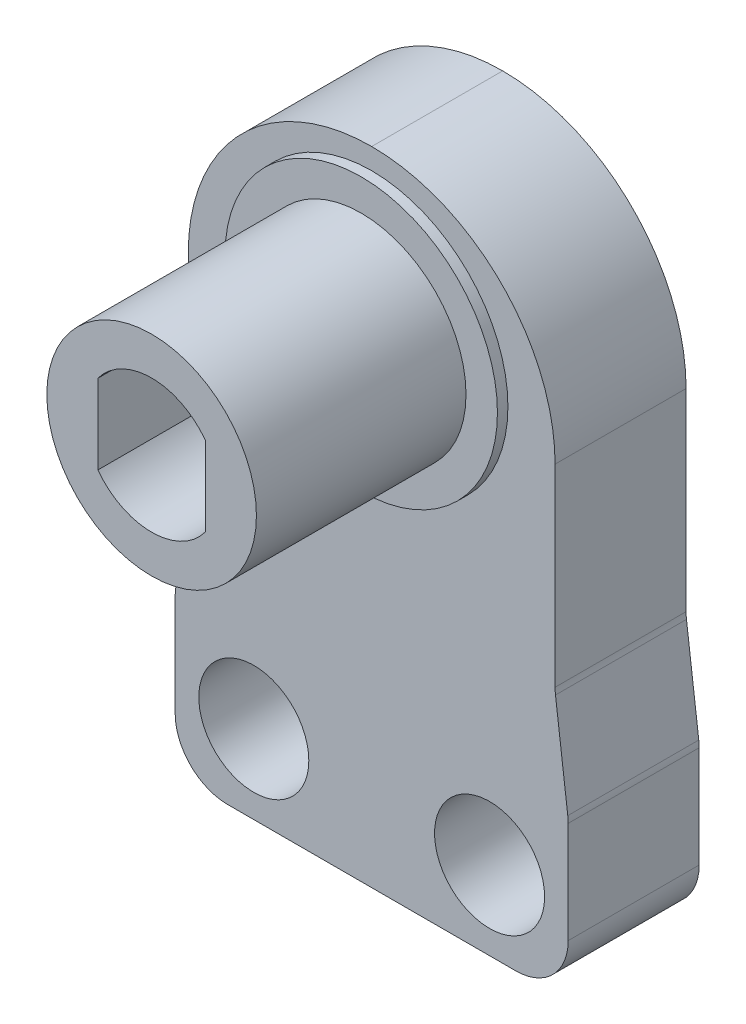
ISO-10303-21;
HEADER;
FILE_DESCRIPTION(('STEP AP214'),'2;1');
FILE_NAME('part.step','',(''),(''),'','','');
FILE_SCHEMA(('AUTOMOTIVE_DESIGN { 1 0 10303 214 1 1 1 1 }'));
ENDSEC;
DATA;
#1=APPLICATION_CONTEXT('core data for automotive mechanical design processes');
#2=APPLICATION_PROTOCOL_DEFINITION('international standard','automotive_design',2000,#1);
#3=PRODUCT_CONTEXT('',#1,'mechanical');
#4=PRODUCT('Part','Part','',(#3));
#5=PRODUCT_RELATED_PRODUCT_CATEGORY('part','',(#4));
#6=PRODUCT_DEFINITION_FORMATION('','',#4);
#7=PRODUCT_DEFINITION_CONTEXT('part definition',#1,'design');
#8=PRODUCT_DEFINITION('design','',#6,#7);
#9=PRODUCT_DEFINITION_SHAPE('','',#8);
#10=(LENGTH_UNIT() NAMED_UNIT(*) SI_UNIT(.MILLI.,.METRE.));
#11=(NAMED_UNIT(*) PLANE_ANGLE_UNIT() SI_UNIT($,.RADIAN.));
#12=(NAMED_UNIT(*) SI_UNIT($,.STERADIAN.) SOLID_ANGLE_UNIT());
#13=UNCERTAINTY_MEASURE_WITH_UNIT(LENGTH_MEASURE(1.E-05),#10,'distance_accuracy_value','');
#14=(GEOMETRIC_REPRESENTATION_CONTEXT(3) GLOBAL_UNCERTAINTY_ASSIGNED_CONTEXT((#13)) GLOBAL_UNIT_ASSIGNED_CONTEXT((#10,
#11,#12)) REPRESENTATION_CONTEXT('',''));
#15=CARTESIAN_POINT('',(0.,0.,0.));
#16=DIRECTION('',(0.,0.,1.));
#17=DIRECTION('',(1.,0.,0.));
#18=AXIS2_PLACEMENT_3D('',#15,#16,#17);
#19=CARTESIAN_POINT('',(0.,0.,-41.5));
#20=DIRECTION('',(0.,0.,-1.));
#21=DIRECTION('',(-1.,0.,0.));
#22=AXIS2_PLACEMENT_3D('',#19,#20,#21);
#23=PLANE('',#22);
#24=DIRECTION('',(-0.124034734589207,-0.992277876713668,0.));
#25=VECTOR('',#24,1.);
#26=CARTESIAN_POINT('',(-7.,21.5,-41.5));
#27=LINE('',#26,#25);
#28=CARTESIAN_POINT('',(-7.01544424657267,21.3764460274187,-41.5));
#29=VERTEX_POINT('',#28);
#30=CARTESIAN_POINT('',(-7.48455575342734,17.6235539725813,-41.5));
#31=VERTEX_POINT('',#30);
#32=EDGE_CURVE('E464',#29,#31,#27,.T.);
#33=ORIENTED_EDGE('',*,*,#32,.T.);
#34=CARTESIAN_POINT('',(-5.5,17.3754845034029,-41.5));
#35=DIRECTION('',(0.,0.,-1.));
#36=DIRECTION('',(-1.,0.,0.));
#37=AXIS2_PLACEMENT_3D('',#34,#35,#36);
#38=CIRCLE('',#37,2.);
#39=CARTESIAN_POINT('',(-7.5,17.3754845034029,-41.5));
#40=VERTEX_POINT('',#39);
#41=EDGE_CURVE('E447',#31,#40,#38,.F.);
#42=ORIENTED_EDGE('',*,*,#41,.T.);
#43=DIRECTION('',(0.,-1.,0.));
#44=VECTOR('',#43,1.);
#45=CARTESIAN_POINT('',(-7.5,17.5,-41.5));
#46=LINE('',#45,#44);
#47=CARTESIAN_POINT('',(-7.5,13.5,-41.5));
#48=VERTEX_POINT('',#47);
#49=EDGE_CURVE('E470',#40,#48,#46,.T.);
#50=ORIENTED_EDGE('',*,*,#49,.T.);
#51=CARTESIAN_POINT('',(-5.5,13.5,-41.5));
#52=DIRECTION('',(0.,0.,-1.));
#53=DIRECTION('',(-1.,0.,0.));
#54=AXIS2_PLACEMENT_3D('',#51,#52,#53);
#55=CIRCLE('',#54,2.);
#56=CARTESIAN_POINT('',(-5.5,11.5,-41.5));
#57=VERTEX_POINT('',#56);
#58=EDGE_CURVE('E449',#48,#57,#55,.F.);
#59=ORIENTED_EDGE('',*,*,#58,.T.);
#60=DIRECTION('',(1.,0.,0.));
#61=VECTOR('',#60,1.);
#62=CARTESIAN_POINT('',(-7.5,11.5,-41.5));
#63=LINE('',#62,#61);
#64=CARTESIAN_POINT('',(5.5,11.5,-41.5));
#65=VERTEX_POINT('',#64);
#66=EDGE_CURVE('E473',#57,#65,#63,.T.);
#67=ORIENTED_EDGE('',*,*,#66,.T.);
#68=CARTESIAN_POINT('',(5.5,13.5,-41.5));
#69=DIRECTION('',(0.,0.,-1.));
#70=DIRECTION('',(-1.,0.,0.));
#71=AXIS2_PLACEMENT_3D('',#68,#69,#70);
#72=CIRCLE('',#71,2.);
#73=CARTESIAN_POINT('',(7.5,13.5,-41.5));
#74=VERTEX_POINT('',#73);
#75=EDGE_CURVE('E451',#65,#74,#72,.F.);
#76=ORIENTED_EDGE('',*,*,#75,.T.);
#77=DIRECTION('',(0.,1.,0.));
#78=VECTOR('',#77,1.);
#79=CARTESIAN_POINT('',(7.5,11.5,-41.5));
#80=LINE('',#79,#78);
#81=CARTESIAN_POINT('',(7.5,17.3754845034029,-41.5));
#82=VERTEX_POINT('',#81);
#83=EDGE_CURVE('E482',#74,#82,#80,.T.);
#84=ORIENTED_EDGE('',*,*,#83,.T.);
#85=CARTESIAN_POINT('',(5.5,17.3754845034029,-41.5));
#86=DIRECTION('',(0.,0.,-1.));
#87=DIRECTION('',(-1.,0.,0.));
#88=AXIS2_PLACEMENT_3D('',#85,#86,#87);
#89=CIRCLE('',#88,2.);
#90=CARTESIAN_POINT('',(7.48455575342734,17.6235539725813,-41.5));
#91=VERTEX_POINT('',#90);
#92=EDGE_CURVE('E453',#82,#91,#89,.F.);
#93=ORIENTED_EDGE('',*,*,#92,.T.);
#94=DIRECTION('',(-0.124034734589207,0.992277876713668,0.));
#95=VECTOR('',#94,1.);
#96=CARTESIAN_POINT('',(7.5,17.5,-41.5));
#97=LINE('',#96,#95);
#98=CARTESIAN_POINT('',(7.01544424657265,21.3764460274188,-41.5));
#99=VERTEX_POINT('',#98);
#100=EDGE_CURVE('E484',#91,#99,#97,.T.);
#101=ORIENTED_EDGE('',*,*,#100,.T.);
#102=CARTESIAN_POINT('',(8.99999999999999,21.6245154965972,-41.5));
#103=DIRECTION('',(0.,0.,-1.));
#104=DIRECTION('',(-1.,0.,0.));
#105=AXIS2_PLACEMENT_3D('',#102,#103,#104);
#106=CIRCLE('',#105,2.);
#107=CARTESIAN_POINT('',(6.99999999999999,21.6245154965972,-41.5));
#108=VERTEX_POINT('',#107);
#109=EDGE_CURVE('E416',#99,#108,#106,.T.);
#110=ORIENTED_EDGE('',*,*,#109,.T.);
#111=DIRECTION('',(0.,-1.,0.));
#112=VECTOR('',#111,1.);
#113=CARTESIAN_POINT('',(6.99999999999999,36.,-41.5));
#114=LINE('',#113,#112);
#115=CARTESIAN_POINT('',(6.99999999999999,29.,-41.5));
#116=VERTEX_POINT('',#115);
#117=EDGE_CURVE('E237',#116,#108,#114,.T.);
#118=ORIENTED_EDGE('',*,*,#117,.F.);
#119=CARTESIAN_POINT('',(0.,29.,-41.5));
#120=DIRECTION('',(0.,0.,-1.));
#121=DIRECTION('',(-1.,0.,0.));
#122=AXIS2_PLACEMENT_3D('',#119,#120,#121);
#123=CIRCLE('',#122,7.);
#124=CARTESIAN_POINT('',(0.,36.,-41.5));
#125=VERTEX_POINT('',#124);
#126=EDGE_CURVE('E260',#116,#125,#123,.F.);
#127=ORIENTED_EDGE('',*,*,#126,.T.);
#128=CARTESIAN_POINT('',(0.,29.,-41.5));
#129=DIRECTION('',(0.,0.,-1.));
#130=DIRECTION('',(-1.,0.,0.));
#131=AXIS2_PLACEMENT_3D('',#128,#129,#130);
#132=CIRCLE('',#131,7.);
#133=CARTESIAN_POINT('',(-7.00000000000001,29.,-41.5));
#134=VERTEX_POINT('',#133);
#135=EDGE_CURVE('E257',#125,#134,#132,.F.);
#136=ORIENTED_EDGE('',*,*,#135,.T.);
#137=DIRECTION('',(0.,1.,0.));
#138=VECTOR('',#137,1.);
#139=CARTESIAN_POINT('',(-7.,10.,-41.5));
#140=LINE('',#139,#138);
#141=CARTESIAN_POINT('',(-7.00000000000001,21.6245154965971,-41.5));
#142=VERTEX_POINT('',#141);
#143=EDGE_CURVE('E235',#142,#134,#140,.T.);
#144=ORIENTED_EDGE('',*,*,#143,.F.);
#145=CARTESIAN_POINT('',(-9.00000000000001,21.6245154965971,-41.5));
#146=DIRECTION('',(0.,0.,-1.));
#147=DIRECTION('',(-1.,0.,0.));
#148=AXIS2_PLACEMENT_3D('',#145,#146,#147);
#149=CIRCLE('',#148,2.);
#150=EDGE_CURVE('E50',#142,#29,#149,.T.);
#151=ORIENTED_EDGE('',*,*,#150,.T.);
#152=EDGE_LOOP('',(#33,#42,#50,#59,#67,#76,#84,#93,#101,#110,#118,#127,#136,#144,#151));
#153=FACE_BOUND('',#152,.T.);
#154=CARTESIAN_POINT('',(0.,30.,-41.5));
#155=DIRECTION('',(0.,0.,-1.));
#156=DIRECTION('',(-1.,0.,0.));
#157=AXIS2_PLACEMENT_3D('',#154,#155,#156);
#158=CIRCLE('',#157,5.2);
#159=CARTESIAN_POINT('',(-5.20000000000001,30.,-41.5));
#160=VERTEX_POINT('',#159);
#161=EDGE_CURVE('E241',#160,#160,#158,.F.);
#162=ORIENTED_EDGE('',*,*,#161,.F.);
#163=EDGE_LOOP('',(#162));
#164=FACE_BOUND('',#163,.T.);
#165=CARTESIAN_POINT('',(4.5,14.5,-41.5));
#166=DIRECTION('',(0.,0.,1.));
#167=DIRECTION('',(1.,0.,0.));
#168=AXIS2_PLACEMENT_3D('',#165,#166,#167);
#169=CIRCLE('',#168,2.1);
#170=CARTESIAN_POINT('',(6.6,14.5,-41.5));
#171=VERTEX_POINT('',#170);
#172=EDGE_CURVE('E476',#171,#171,#169,.T.);
#173=ORIENTED_EDGE('',*,*,#172,.F.);
#174=EDGE_LOOP('',(#173));
#175=FACE_BOUND('',#174,.T.);
#176=CARTESIAN_POINT('',(-4.5,14.5,-41.5));
#177=DIRECTION('',(0.,0.,1.));
#178=DIRECTION('',(1.,0.,0.));
#179=AXIS2_PLACEMENT_3D('',#176,#177,#178);
#180=CIRCLE('',#179,2.1);
#181=CARTESIAN_POINT('',(-2.4,14.5,-41.5));
#182=VERTEX_POINT('',#181);
#183=EDGE_CURVE('E471',#182,#182,#180,.T.);
#184=ORIENTED_EDGE('',*,*,#183,.F.);
#185=EDGE_LOOP('',(#184));
#186=FACE_BOUND('',#185,.T.);
#187=ADVANCED_FACE('F42',(#153,#164,#175,#186),#23,.F.);
#188=CARTESIAN_POINT('',(-35.7,10.,-46.5));
#189=DIRECTION('',(0.,0.,1.));
#190=DIRECTION('',(1.,0.,0.));
#191=AXIS2_PLACEMENT_3D('',#188,#189,#190);
#192=PLANE('',#191);
#193=DIRECTION('',(0.,1.,0.));
#194=VECTOR('',#193,1.);
#195=CARTESIAN_POINT('',(-7.5,17.5,-46.5));
#196=LINE('',#195,#194);
#197=CARTESIAN_POINT('',(-7.5,13.5,-46.5));
#198=VERTEX_POINT('',#197);
#199=CARTESIAN_POINT('',(-7.5,17.3754845034029,-46.5));
#200=VERTEX_POINT('',#199);
#201=EDGE_CURVE('E486',#198,#200,#196,.T.);
#202=ORIENTED_EDGE('',*,*,#201,.T.);
#203=CARTESIAN_POINT('',(-5.5,17.3754845034029,-46.5));
#204=DIRECTION('',(0.,0.,1.));
#205=DIRECTION('',(1.,0.,0.));
#206=AXIS2_PLACEMENT_3D('',#203,#204,#205);
#207=CIRCLE('',#206,2.);
#208=CARTESIAN_POINT('',(-7.48455575342734,17.6235539725813,-46.5));
#209=VERTEX_POINT('',#208);
#210=EDGE_CURVE('E434',#200,#209,#207,.F.);
#211=ORIENTED_EDGE('',*,*,#210,.T.);
#212=DIRECTION('',(0.124034734589207,0.992277876713668,0.));
#213=VECTOR('',#212,1.);
#214=CARTESIAN_POINT('',(-7.,21.5,-46.5));
#215=LINE('',#214,#213);
#216=CARTESIAN_POINT('',(-7.01544424657267,21.3764460274187,-46.5));
#217=VERTEX_POINT('',#216);
#218=EDGE_CURVE('E462',#209,#217,#215,.T.);
#219=ORIENTED_EDGE('',*,*,#218,.T.);
#220=CARTESIAN_POINT('',(-9.00000000000001,21.6245154965971,-46.5));
#221=DIRECTION('',(0.,0.,1.));
#222=DIRECTION('',(1.,0.,0.));
#223=AXIS2_PLACEMENT_3D('',#220,#221,#222);
#224=CIRCLE('',#223,2.);
#225=CARTESIAN_POINT('',(-7.00000000000001,21.6245154965971,-46.5));
#226=VERTEX_POINT('',#225);
#227=EDGE_CURVE('E11',#217,#226,#224,.T.);
#228=ORIENTED_EDGE('',*,*,#227,.T.);
#229=DIRECTION('',(0.,1.,0.));
#230=VECTOR('',#229,1.);
#231=CARTESIAN_POINT('',(-7.,10.,-46.5));
#232=LINE('',#231,#230);
#233=CARTESIAN_POINT('',(-7.00000000000001,29.,-46.5));
#234=VERTEX_POINT('',#233);
#235=EDGE_CURVE('E234',#226,#234,#232,.T.);
#236=ORIENTED_EDGE('',*,*,#235,.T.);
#237=CARTESIAN_POINT('',(0.,29.,-46.5));
#238=DIRECTION('',(0.,0.,1.));
#239=DIRECTION('',(1.,0.,0.));
#240=AXIS2_PLACEMENT_3D('',#237,#238,#239);
#241=CIRCLE('',#240,7.);
#242=CARTESIAN_POINT('',(0.,36.,-46.5));
#243=VERTEX_POINT('',#242);
#244=EDGE_CURVE('E253',#234,#243,#241,.F.);
#245=ORIENTED_EDGE('',*,*,#244,.T.);
#246=CARTESIAN_POINT('',(0.,29.,-46.5));
#247=DIRECTION('',(0.,0.,1.));
#248=DIRECTION('',(1.,0.,0.));
#249=AXIS2_PLACEMENT_3D('',#246,#247,#248);
#250=CIRCLE('',#249,7.);
#251=CARTESIAN_POINT('',(6.99999999999999,29.,-46.5));
#252=VERTEX_POINT('',#251);
#253=EDGE_CURVE('E255',#243,#252,#250,.F.);
#254=ORIENTED_EDGE('',*,*,#253,.T.);
#255=DIRECTION('',(0.,-1.,0.));
#256=VECTOR('',#255,1.);
#257=CARTESIAN_POINT('',(6.99999999999999,36.,-46.5));
#258=LINE('',#257,#256);
#259=CARTESIAN_POINT('',(6.99999999999999,21.6245154965972,-46.5));
#260=VERTEX_POINT('',#259);
#261=EDGE_CURVE('E238',#252,#260,#258,.T.);
#262=ORIENTED_EDGE('',*,*,#261,.T.);
#263=CARTESIAN_POINT('',(8.99999999999999,21.6245154965972,-46.5));
#264=DIRECTION('',(0.,0.,1.));
#265=DIRECTION('',(1.,0.,0.));
#266=AXIS2_PLACEMENT_3D('',#263,#264,#265);
#267=CIRCLE('',#266,2.);
#268=CARTESIAN_POINT('',(7.01544424657265,21.3764460274188,-46.5));
#269=VERTEX_POINT('',#268);
#270=EDGE_CURVE('E411',#260,#269,#267,.T.);
#271=ORIENTED_EDGE('',*,*,#270,.T.);
#272=DIRECTION('',(0.124034734589207,-0.992277876713668,0.));
#273=VECTOR('',#272,1.);
#274=CARTESIAN_POINT('',(7.5,17.5,-46.5));
#275=LINE('',#274,#273);
#276=CARTESIAN_POINT('',(7.48455575342734,17.6235539725813,-46.5));
#277=VERTEX_POINT('',#276);
#278=EDGE_CURVE('E466',#269,#277,#275,.T.);
#279=ORIENTED_EDGE('',*,*,#278,.T.);
#280=CARTESIAN_POINT('',(5.5,17.3754845034029,-46.5));
#281=DIRECTION('',(0.,0.,1.));
#282=DIRECTION('',(1.,0.,0.));
#283=AXIS2_PLACEMENT_3D('',#280,#281,#282);
#284=CIRCLE('',#283,2.);
#285=CARTESIAN_POINT('',(7.5,17.3754845034029,-46.5));
#286=VERTEX_POINT('',#285);
#287=EDGE_CURVE('E440',#277,#286,#284,.F.);
#288=ORIENTED_EDGE('',*,*,#287,.T.);
#289=DIRECTION('',(0.,-1.,0.));
#290=VECTOR('',#289,1.);
#291=CARTESIAN_POINT('',(7.5,11.5,-46.5));
#292=LINE('',#291,#290);
#293=CARTESIAN_POINT('',(7.5,13.5,-46.5));
#294=VERTEX_POINT('',#293);
#295=EDGE_CURVE('E491',#286,#294,#292,.T.);
#296=ORIENTED_EDGE('',*,*,#295,.T.);
#297=CARTESIAN_POINT('',(5.5,13.5,-46.5));
#298=DIRECTION('',(0.,0.,1.));
#299=DIRECTION('',(1.,0.,0.));
#300=AXIS2_PLACEMENT_3D('',#297,#298,#299);
#301=CIRCLE('',#300,2.);
#302=CARTESIAN_POINT('',(5.5,11.5,-46.5));
#303=VERTEX_POINT('',#302);
#304=EDGE_CURVE('E438',#294,#303,#301,.F.);
#305=ORIENTED_EDGE('',*,*,#304,.T.);
#306=DIRECTION('',(-1.,0.,0.));
#307=VECTOR('',#306,1.);
#308=CARTESIAN_POINT('',(-7.5,11.5,-46.5));
#309=LINE('',#308,#307);
#310=CARTESIAN_POINT('',(-5.5,11.5,-46.5));
#311=VERTEX_POINT('',#310);
#312=EDGE_CURVE('E488',#303,#311,#309,.T.);
#313=ORIENTED_EDGE('',*,*,#312,.T.);
#314=CARTESIAN_POINT('',(-5.5,13.5,-46.5));
#315=DIRECTION('',(0.,0.,1.));
#316=DIRECTION('',(1.,0.,0.));
#317=AXIS2_PLACEMENT_3D('',#314,#315,#316);
#318=CIRCLE('',#317,2.);
#319=EDGE_CURVE('E436',#311,#198,#318,.F.);
#320=ORIENTED_EDGE('',*,*,#319,.T.);
#321=EDGE_LOOP('',(#202,#211,#219,#228,#236,#245,#254,#262,#271,#279,#288,#296,#305,#313,#320));
#322=FACE_BOUND('',#321,.T.);
#323=CARTESIAN_POINT('',(0.,30.,-46.5));
#324=DIRECTION('',(0.,0.,1.));
#325=DIRECTION('',(1.,0.,0.));
#326=AXIS2_PLACEMENT_3D('',#323,#324,#325);
#327=CIRCLE('',#326,3.05);
#328=CARTESIAN_POINT('',(2.54999999999998,31.6733200530682,-46.5));
#329=VERTEX_POINT('',#328);
#330=CARTESIAN_POINT('',(-2.55000000000001,31.6733200530681,-46.5));
#331=VERTEX_POINT('',#330);
#332=EDGE_CURVE('E271',#329,#331,#327,.T.);
#333=ORIENTED_EDGE('',*,*,#332,.T.);
#334=DIRECTION('',(0.,-1.,0.));
#335=VECTOR('',#334,1.);
#336=CARTESIAN_POINT('',(-2.55000000000001,10.,-46.5));
#337=LINE('',#336,#335);
#338=CARTESIAN_POINT('',(-2.55000000000001,28.3266799469319,-46.5));
#339=VERTEX_POINT('',#338);
#340=EDGE_CURVE('E273',#331,#339,#337,.T.);
#341=ORIENTED_EDGE('',*,*,#340,.T.);
#342=CARTESIAN_POINT('',(0.,30.,-46.5));
#343=DIRECTION('',(0.,0.,1.));
#344=DIRECTION('',(1.,0.,0.));
#345=AXIS2_PLACEMENT_3D('',#342,#343,#344);
#346=CIRCLE('',#345,3.05);
#347=CARTESIAN_POINT('',(2.54999999999998,28.3266799469318,-46.5));
#348=VERTEX_POINT('',#347);
#349=EDGE_CURVE('E267',#339,#348,#346,.T.);
#350=ORIENTED_EDGE('',*,*,#349,.T.);
#351=DIRECTION('',(0.,1.,0.));
#352=VECTOR('',#351,1.);
#353=CARTESIAN_POINT('',(2.54999999999998,10.,-46.5));
#354=LINE('',#353,#352);
#355=EDGE_CURVE('E269',#348,#329,#354,.T.);
#356=ORIENTED_EDGE('',*,*,#355,.T.);
#357=EDGE_LOOP('',(#333,#341,#350,#356));
#358=FACE_BOUND('',#357,.T.);
#359=CARTESIAN_POINT('',(4.5,14.5,-46.5));
#360=DIRECTION('',(0.,0.,1.));
#361=DIRECTION('',(1.,0.,0.));
#362=AXIS2_PLACEMENT_3D('',#359,#360,#361);
#363=CIRCLE('',#362,2.1);
#364=CARTESIAN_POINT('',(6.6,14.5,-46.5));
#365=VERTEX_POINT('',#364);
#366=EDGE_CURVE('E213',#365,#365,#363,.F.);
#367=ORIENTED_EDGE('',*,*,#366,.F.);
#368=EDGE_LOOP('',(#367));
#369=FACE_BOUND('',#368,.T.);
#370=CARTESIAN_POINT('',(-4.5,14.5,-46.5));
#371=DIRECTION('',(0.,0.,1.));
#372=DIRECTION('',(1.,0.,0.));
#373=AXIS2_PLACEMENT_3D('',#370,#371,#372);
#374=CIRCLE('',#373,2.1);
#375=CARTESIAN_POINT('',(-2.4,14.5,-46.5));
#376=VERTEX_POINT('',#375);
#377=EDGE_CURVE('E291',#376,#376,#374,.F.);
#378=ORIENTED_EDGE('',*,*,#377,.F.);
#379=EDGE_LOOP('',(#378));
#380=FACE_BOUND('',#379,.T.);
#381=ADVANCED_FACE('F360',(#322,#358,#369,#380),#192,.F.);
#382=CARTESIAN_POINT('',(6.99999999999999,36.,-41.5));
#383=DIRECTION('',(1.,0.,0.));
#384=DIRECTION('',(0.,0.,-1.));
#385=AXIS2_PLACEMENT_3D('',#382,#383,#384);
#386=PLANE('',#385);
#387=ORIENTED_EDGE('',*,*,#117,.T.);
#388=DIRECTION('',(0.,0.,1.));
#389=VECTOR('',#388,1.);
#390=CARTESIAN_POINT('',(6.99999999999999,21.6245154965972,-46.5));
#391=LINE('',#390,#389);
#392=EDGE_CURVE('E407',#108,#260,#391,.F.);
#393=ORIENTED_EDGE('',*,*,#392,.T.);
#394=ORIENTED_EDGE('',*,*,#261,.F.);
#395=DIRECTION('',(0.,0.,-1.));
#396=VECTOR('',#395,1.);
#397=CARTESIAN_POINT('',(6.99999999999999,29.,-41.5));
#398=LINE('',#397,#396);
#399=EDGE_CURVE('E247',#252,#116,#398,.F.);
#400=ORIENTED_EDGE('',*,*,#399,.T.);
#401=EDGE_LOOP('',(#387,#393,#394,#400));
#402=FACE_BOUND('',#401,.T.);
#403=ADVANCED_FACE('F366',(#402),#386,.T.);
#404=CARTESIAN_POINT('',(-7.,10.,-41.5));
#405=DIRECTION('',(-1.,0.,0.));
#406=DIRECTION('',(0.,0.,1.));
#407=AXIS2_PLACEMENT_3D('',#404,#405,#406);
#408=PLANE('',#407);
#409=ORIENTED_EDGE('',*,*,#235,.F.);
#410=DIRECTION('',(0.,0.,1.));
#411=VECTOR('',#410,1.);
#412=CARTESIAN_POINT('',(-7.00000000000001,21.6245154965971,-41.5));
#413=LINE('',#412,#411);
#414=EDGE_CURVE('E401',#226,#142,#413,.T.);
#415=ORIENTED_EDGE('',*,*,#414,.T.);
#416=ORIENTED_EDGE('',*,*,#143,.T.);
#417=DIRECTION('',(0.,0.,-1.));
#418=VECTOR('',#417,1.);
#419=CARTESIAN_POINT('',(-7.00000000000001,29.,-41.5));
#420=LINE('',#419,#418);
#421=EDGE_CURVE('E250',#134,#234,#420,.T.);
#422=ORIENTED_EDGE('',*,*,#421,.T.);
#423=EDGE_LOOP('',(#409,#415,#416,#422));
#424=FACE_BOUND('',#423,.T.);
#425=ADVANCED_FACE('F376',(#424),#408,.T.);
#426=CARTESIAN_POINT('',(0.,30.,-33.1));
#427=DIRECTION('',(0.,0.,1.));
#428=DIRECTION('',(1.,0.,0.));
#429=AXIS2_PLACEMENT_3D('',#426,#427,#428);
#430=PLANE('',#429);
#431=CARTESIAN_POINT('',(0.,30.,-33.1));
#432=DIRECTION('',(0.,0.,1.));
#433=DIRECTION('',(1.,0.,0.));
#434=AXIS2_PLACEMENT_3D('',#431,#432,#433);
#435=CIRCLE('',#434,4.);
#436=CARTESIAN_POINT('',(3.99999999999999,30.,-33.1));
#437=VERTEX_POINT('',#436);
#438=EDGE_CURVE('E231',#437,#437,#435,.T.);
#439=ORIENTED_EDGE('',*,*,#438,.T.);
#440=EDGE_LOOP('',(#439));
#441=FACE_BOUND('',#440,.T.);
#442=DIRECTION('',(0.,1.,0.));
#443=VECTOR('',#442,1.);
#444=CARTESIAN_POINT('',(-2.05000000000001,28.4834249111897,-33.1));
#445=LINE('',#444,#443);
#446=CARTESIAN_POINT('',(-2.05000000000001,28.4834249111897,-33.1));
#447=VERTEX_POINT('',#446);
#448=CARTESIAN_POINT('',(-2.05000000000001,31.5165750888103,-33.1));
#449=VERTEX_POINT('',#448);
#450=EDGE_CURVE('E196',#447,#449,#445,.T.);
#451=ORIENTED_EDGE('',*,*,#450,.T.);
#452=CARTESIAN_POINT('',(0.,30.,-33.1));
#453=DIRECTION('',(0.,0.,1.));
#454=DIRECTION('',(1.,0.,0.));
#455=AXIS2_PLACEMENT_3D('',#452,#453,#454);
#456=CIRCLE('',#455,2.55);
#457=CARTESIAN_POINT('',(2.04999999999999,31.5165750888103,-33.1));
#458=VERTEX_POINT('',#457);
#459=EDGE_CURVE('E190',#449,#458,#456,.F.);
#460=ORIENTED_EDGE('',*,*,#459,.T.);
#461=DIRECTION('',(0.,-1.,0.));
#462=VECTOR('',#461,1.);
#463=CARTESIAN_POINT('',(2.04999999999999,31.5165750888103,-33.1));
#464=LINE('',#463,#462);
#465=CARTESIAN_POINT('',(2.04999999999999,28.4834249111897,-33.1));
#466=VERTEX_POINT('',#465);
#467=EDGE_CURVE('E200',#458,#466,#464,.T.);
#468=ORIENTED_EDGE('',*,*,#467,.T.);
#469=CARTESIAN_POINT('',(0.,30.,-33.1));
#470=DIRECTION('',(0.,0.,1.));
#471=DIRECTION('',(1.,0.,0.));
#472=AXIS2_PLACEMENT_3D('',#469,#470,#471);
#473=CIRCLE('',#472,2.55);
#474=EDGE_CURVE('E206',#466,#447,#473,.F.);
#475=ORIENTED_EDGE('',*,*,#474,.T.);
#476=EDGE_LOOP('',(#451,#460,#468,#475));
#477=FACE_BOUND('',#476,.T.);
#478=ADVANCED_FACE('F209',(#441,#477),#430,.T.);
#479=CARTESIAN_POINT('',(0.,30.,-33.1));
#480=DIRECTION('',(0.,0.,-1.));
#481=DIRECTION('',(-1.,0.,0.));
#482=AXIS2_PLACEMENT_3D('',#479,#480,#481);
#483=CYLINDRICAL_SURFACE('',#482,4.);
#484=CARTESIAN_POINT('',(0.,30.,-41.1));
#485=DIRECTION('',(0.,0.,1.));
#486=DIRECTION('',(1.,0.,0.));
#487=AXIS2_PLACEMENT_3D('',#484,#485,#486);
#488=CIRCLE('',#487,4.);
#489=CARTESIAN_POINT('',(3.99999999999999,30.,-41.1));
#490=VERTEX_POINT('',#489);
#491=EDGE_CURVE('E225',#490,#490,#488,.T.);
#492=ORIENTED_EDGE('',*,*,#491,.T.);
#493=EDGE_LOOP('',(#492));
#494=FACE_BOUND('',#493,.T.);
#495=ORIENTED_EDGE('',*,*,#438,.F.);
#496=EDGE_LOOP('',(#495));
#497=FACE_BOUND('',#496,.T.);
#498=ADVANCED_FACE('F372',(#494,#497),#483,.T.);
#499=CARTESIAN_POINT('',(0.,30.,-41.1));
#500=DIRECTION('',(0.,0.,1.));
#501=DIRECTION('',(1.,0.,0.));
#502=AXIS2_PLACEMENT_3D('',#499,#500,#501);
#503=PLANE('',#502);
#504=CARTESIAN_POINT('',(0.,30.,-41.1));
#505=DIRECTION('',(0.,0.,1.));
#506=DIRECTION('',(1.,0.,0.));
#507=AXIS2_PLACEMENT_3D('',#504,#505,#506);
#508=CIRCLE('',#507,5.2);
#509=CARTESIAN_POINT('',(5.19999999999999,30.,-41.1));
#510=VERTEX_POINT('',#509);
#511=EDGE_CURVE('E228',#510,#510,#508,.T.);
#512=ORIENTED_EDGE('',*,*,#511,.T.);
#513=EDGE_LOOP('',(#512));
#514=FACE_BOUND('',#513,.T.);
#515=ORIENTED_EDGE('',*,*,#491,.F.);
#516=EDGE_LOOP('',(#515));
#517=FACE_BOUND('',#516,.T.);
#518=ADVANCED_FACE('F391',(#514,#517),#503,.T.);
#519=CARTESIAN_POINT('',(0.,30.,-41.1));
#520=DIRECTION('',(0.,0.,-1.));
#521=DIRECTION('',(-1.,0.,0.));
#522=AXIS2_PLACEMENT_3D('',#519,#520,#521);
#523=CYLINDRICAL_SURFACE('',#522,5.2);
#524=ORIENTED_EDGE('',*,*,#511,.F.);
#525=EDGE_LOOP('',(#524));
#526=FACE_BOUND('',#525,.T.);
#527=ORIENTED_EDGE('',*,*,#161,.T.);
#528=EDGE_LOOP('',(#527));
#529=FACE_BOUND('',#528,.T.);
#530=ADVANCED_FACE('F386',(#526,#529),#523,.T.);
#531=CARTESIAN_POINT('',(0.,29.,-41.5));
#532=DIRECTION('',(0.,0.,-1.));
#533=DIRECTION('',(-1.,0.,0.));
#534=AXIS2_PLACEMENT_3D('',#531,#532,#533);
#535=CYLINDRICAL_SURFACE('',#534,7.);
#536=ORIENTED_EDGE('',*,*,#421,.F.);
#537=ORIENTED_EDGE('',*,*,#135,.F.);
#538=DIRECTION('',(0.,0.,-1.));
#539=VECTOR('',#538,1.);
#540=CARTESIAN_POINT('',(0.,36.,-41.5));
#541=LINE('',#540,#539);
#542=EDGE_CURVE('E216',#243,#125,#541,.F.);
#543=ORIENTED_EDGE('',*,*,#542,.F.);
#544=ORIENTED_EDGE('',*,*,#244,.F.);
#545=EDGE_LOOP('',(#536,#537,#543,#544));
#546=FACE_BOUND('',#545,.T.);
#547=ADVANCED_FACE('F383',(#546),#535,.T.);
#548=CARTESIAN_POINT('',(0.,29.,-41.5));
#549=DIRECTION('',(0.,0.,-1.));
#550=DIRECTION('',(-1.,0.,0.));
#551=AXIS2_PLACEMENT_3D('',#548,#549,#550);
#552=CYLINDRICAL_SURFACE('',#551,7.);
#553=ORIENTED_EDGE('',*,*,#126,.F.);
#554=ORIENTED_EDGE('',*,*,#399,.F.);
#555=ORIENTED_EDGE('',*,*,#253,.F.);
#556=ORIENTED_EDGE('',*,*,#542,.T.);
#557=EDGE_LOOP('',(#553,#554,#555,#556));
#558=FACE_BOUND('',#557,.T.);
#559=ADVANCED_FACE('F381',(#558),#552,.T.);
#560=CARTESIAN_POINT('',(0.,30.,-25.321825406948));
#561=DIRECTION('',(0.,0.,-1.));
#562=DIRECTION('',(-1.,0.,0.));
#563=AXIS2_PLACEMENT_3D('',#560,#561,#562);
#564=CYLINDRICAL_SURFACE('',#563,2.55);
#565=DIRECTION('',(0.,0.,-1.));
#566=VECTOR('',#565,1.);
#567=CARTESIAN_POINT('',(-2.05000000000001,31.5165750888103,-25.321825406948));
#568=LINE('',#567,#566);
#569=CARTESIAN_POINT('',(-2.05000000000001,31.5165750888103,-46.));
#570=VERTEX_POINT('',#569);
#571=EDGE_CURVE('E218',#449,#570,#568,.T.);
#572=ORIENTED_EDGE('',*,*,#571,.T.);
#573=CARTESIAN_POINT('',(0.,30.,-46.));
#574=DIRECTION('',(0.,0.,1.));
#575=DIRECTION('',(1.,0.,0.));
#576=AXIS2_PLACEMENT_3D('',#573,#574,#575);
#577=CIRCLE('',#576,2.55);
#578=CARTESIAN_POINT('',(2.04999999999999,31.5165750888103,-46.));
#579=VERTEX_POINT('',#578);
#580=EDGE_CURVE('E193',#570,#579,#577,.F.);
#581=ORIENTED_EDGE('',*,*,#580,.T.);
#582=DIRECTION('',(0.,0.,-1.));
#583=VECTOR('',#582,1.);
#584=CARTESIAN_POINT('',(2.04999999999999,31.5165750888103,-25.321825406948));
#585=LINE('',#584,#583);
#586=EDGE_CURVE('E185',#458,#579,#585,.T.);
#587=ORIENTED_EDGE('',*,*,#586,.F.);
#588=ORIENTED_EDGE('',*,*,#459,.F.);
#589=EDGE_LOOP('',(#572,#581,#587,#588));
#590=FACE_BOUND('',#589,.T.);
#591=ADVANCED_FACE('F188',(#590),#564,.F.);
#592=CARTESIAN_POINT('',(-2.05000000000001,28.4834249111897,-25.321825406948));
#593=DIRECTION('',(-1.,0.,0.));
#594=DIRECTION('',(0.,0.,1.));
#595=AXIS2_PLACEMENT_3D('',#592,#593,#594);
#596=PLANE('',#595);
#597=DIRECTION('',(0.,0.,-1.));
#598=VECTOR('',#597,1.);
#599=CARTESIAN_POINT('',(-2.05,28.4834249111897,-25.321825406948));
#600=LINE('',#599,#598);
#601=CARTESIAN_POINT('',(-2.05000000000001,28.4834249111897,-46.));
#602=VERTEX_POINT('',#601);
#603=EDGE_CURVE('E220',#447,#602,#600,.T.);
#604=ORIENTED_EDGE('',*,*,#603,.T.);
#605=DIRECTION('',(0.,1.,0.));
#606=VECTOR('',#605,1.);
#607=CARTESIAN_POINT('',(-2.05000000000001,28.4834249111897,-46.));
#608=LINE('',#607,#606);
#609=EDGE_CURVE('E262',#602,#570,#608,.T.);
#610=ORIENTED_EDGE('',*,*,#609,.T.);
#611=ORIENTED_EDGE('',*,*,#571,.F.);
#612=ORIENTED_EDGE('',*,*,#450,.F.);
#613=EDGE_LOOP('',(#604,#610,#611,#612));
#614=FACE_BOUND('',#613,.T.);
#615=ADVANCED_FACE('F537',(#614),#596,.F.);
#616=CARTESIAN_POINT('',(0.,30.,-25.321825406948));
#617=DIRECTION('',(0.,0.,-1.));
#618=DIRECTION('',(-1.,0.,0.));
#619=AXIS2_PLACEMENT_3D('',#616,#617,#618);
#620=CYLINDRICAL_SURFACE('',#619,2.55);
#621=DIRECTION('',(0.,0.,-1.));
#622=VECTOR('',#621,1.);
#623=CARTESIAN_POINT('',(2.04999999999999,28.4834249111897,-25.321825406948));
#624=LINE('',#623,#622);
#625=CARTESIAN_POINT('',(2.04999999999999,28.4834249111897,-46.));
#626=VERTEX_POINT('',#625);
#627=EDGE_CURVE('E197',#466,#626,#624,.T.);
#628=ORIENTED_EDGE('',*,*,#627,.T.);
#629=CARTESIAN_POINT('',(0.,30.,-46.));
#630=DIRECTION('',(0.,0.,1.));
#631=DIRECTION('',(1.,0.,0.));
#632=AXIS2_PLACEMENT_3D('',#629,#630,#631);
#633=CIRCLE('',#632,2.55);
#634=EDGE_CURVE('E279',#626,#602,#633,.F.);
#635=ORIENTED_EDGE('',*,*,#634,.T.);
#636=ORIENTED_EDGE('',*,*,#603,.F.);
#637=ORIENTED_EDGE('',*,*,#474,.F.);
#638=EDGE_LOOP('',(#628,#635,#636,#637));
#639=FACE_BOUND('',#638,.T.);
#640=ADVANCED_FACE('F534',(#639),#620,.F.);
#641=CARTESIAN_POINT('',(2.04999999999999,31.5165750888103,-25.321825406948));
#642=DIRECTION('',(1.,0.,0.));
#643=DIRECTION('',(0.,0.,-1.));
#644=AXIS2_PLACEMENT_3D('',#641,#642,#643);
#645=PLANE('',#644);
#646=ORIENTED_EDGE('',*,*,#586,.T.);
#647=DIRECTION('',(0.,-1.,0.));
#648=VECTOR('',#647,1.);
#649=CARTESIAN_POINT('',(2.04999999999999,31.5165750888103,-46.));
#650=LINE('',#649,#648);
#651=EDGE_CURVE('E277',#579,#626,#650,.T.);
#652=ORIENTED_EDGE('',*,*,#651,.T.);
#653=ORIENTED_EDGE('',*,*,#627,.F.);
#654=ORIENTED_EDGE('',*,*,#467,.F.);
#655=EDGE_LOOP('',(#646,#652,#653,#654));
#656=FACE_BOUND('',#655,.T.);
#657=ADVANCED_FACE('F201',(#656),#645,.F.);
#658=CARTESIAN_POINT('',(2.04999999999999,31.5165750888103,-46.));
#659=DIRECTION('',(0.707106781186554,0.,0.707106781186541));
#660=DIRECTION('',(0.,-1.,0.));
#661=AXIS2_PLACEMENT_3D('',#658,#659,#660);
#662=PLANE('',#661);
#663=CARTESIAN_POINT('',(2.04999999999999,31.5165750888103,-46.));
#664=CARTESIAN_POINT('',(2.13314185086007,31.5439222095766,-46.0831418508601));
#665=CARTESIAN_POINT('',(2.21637954343432,31.5706578802699,-46.1663795434343));
#666=CARTESIAN_POINT('',(2.38304621102333,31.6229061958048,-46.3330462110233));
#667=CARTESIAN_POINT('',(2.46647518511574,31.6484188465308,-46.4164751851157));
#668=CARTESIAN_POINT('',(2.54999999999998,31.6733200530682,-46.5));
#669=B_SPLINE_CURVE_WITH_KNOTS('',3,(#663,#664,#665,#666,#667,#668),.UNSPECIFIED.,.F.,.F.,(4,2,
4),(0.,0.362141418728017,0.724281094888482),.UNSPECIFIED.);
#670=EDGE_CURVE('E314',#329,#579,#669,.F.);
#671=ORIENTED_EDGE('',*,*,#670,.F.);
#672=ORIENTED_EDGE('',*,*,#355,.F.);
#673=CARTESIAN_POINT('',(2.04999999999999,28.4834249111897,-46.));
#674=CARTESIAN_POINT('',(2.13314185086007,28.4560777904234,-46.0831418508601));
#675=CARTESIAN_POINT('',(2.21637954343432,28.4293421197301,-46.1663795434343));
#676=CARTESIAN_POINT('',(2.38304621102333,28.3770938041952,-46.3330462110233));
#677=CARTESIAN_POINT('',(2.46647518511574,28.3515811534692,-46.4164751851157));
#678=CARTESIAN_POINT('',(2.54999999999998,28.3266799469318,-46.5));
#679=B_SPLINE_CURVE_WITH_KNOTS('',3,(#673,#674,#675,#676,#677,#678),.UNSPECIFIED.,.F.,.F.,(4,2,
4),(0.,0.362141418728016,0.724281094888482),.UNSPECIFIED.);
#680=EDGE_CURVE('E221',#626,#348,#679,.T.);
#681=ORIENTED_EDGE('',*,*,#680,.F.);
#682=ORIENTED_EDGE('',*,*,#651,.F.);
#683=EDGE_LOOP('',(#671,#672,#681,#682));
#684=FACE_BOUND('',#683,.T.);
#685=ADVANCED_FACE('F327',(#684),#662,.F.);
#686=CARTESIAN_POINT('',(0.,30.,-46.));
#687=DIRECTION('',(0.,0.,-1.));
#688=DIRECTION('',(-1.,0.,0.));
#689=AXIS2_PLACEMENT_3D('',#686,#687,#688);
#690=CONICAL_SURFACE('',#689,2.55,0.785398163397444);
#691=ORIENTED_EDGE('',*,*,#680,.T.);
#692=ORIENTED_EDGE('',*,*,#349,.F.);
#693=CARTESIAN_POINT('',(-2.55000000000001,28.3266799469319,-46.5));
#694=CARTESIAN_POINT('',(-2.46647518511577,28.3515811534692,-46.4164751851157));
#695=CARTESIAN_POINT('',(-2.38304621102336,28.3770938041952,-46.3330462110233));
#696=CARTESIAN_POINT('',(-2.21637954343434,28.4293421197301,-46.1663795434343));
#697=CARTESIAN_POINT('',(-2.13314185086009,28.4560777904234,-46.0831418508601));
#698=CARTESIAN_POINT('',(-2.05000000000001,28.4834249111897,-46.));
#699=B_SPLINE_CURVE_WITH_KNOTS('',3,(#693,#694,#695,#696,#697,#698),.UNSPECIFIED.,.F.,.F.,(4,2,
4),(0.,0.362139676160467,0.724281094888486),.UNSPECIFIED.);
#700=EDGE_CURVE('E290',#602,#339,#699,.F.);
#701=ORIENTED_EDGE('',*,*,#700,.F.);
#702=ORIENTED_EDGE('',*,*,#634,.F.);
#703=EDGE_LOOP('',(#691,#692,#701,#702));
#704=FACE_BOUND('',#703,.T.);
#705=ADVANCED_FACE('F309',(#704),#690,.F.);
#706=CARTESIAN_POINT('',(0.,30.,-46.));
#707=DIRECTION('',(0.,0.,-1.));
#708=DIRECTION('',(-1.,0.,0.));
#709=AXIS2_PLACEMENT_3D('',#706,#707,#708);
#710=CONICAL_SURFACE('',#709,2.55,0.785398163397444);
#711=ORIENTED_EDGE('',*,*,#670,.T.);
#712=ORIENTED_EDGE('',*,*,#580,.F.);
#713=CARTESIAN_POINT('',(-2.05000000000001,31.5165750888103,-46.));
#714=CARTESIAN_POINT('',(-2.13314185086009,31.5439222095766,-46.0831418508601));
#715=CARTESIAN_POINT('',(-2.21637954343434,31.5706578802699,-46.1663795434343));
#716=CARTESIAN_POINT('',(-2.38304621102336,31.6229061958048,-46.3330462110233));
#717=CARTESIAN_POINT('',(-2.46647518511577,31.6484188465308,-46.4164751851157));
#718=CARTESIAN_POINT('',(-2.55000000000001,31.6733200530681,-46.5));
#719=B_SPLINE_CURVE_WITH_KNOTS('',3,(#713,#714,#715,#716,#717,#718),.UNSPECIFIED.,.F.,.F.,(4,2,
4),(0.,0.362141418728018,0.724281094888486),.UNSPECIFIED.);
#720=EDGE_CURVE('E282',#331,#570,#719,.F.);
#721=ORIENTED_EDGE('',*,*,#720,.F.);
#722=ORIENTED_EDGE('',*,*,#332,.F.);
#723=EDGE_LOOP('',(#711,#712,#721,#722));
#724=FACE_BOUND('',#723,.T.);
#725=ADVANCED_FACE('F303',(#724),#710,.F.);
#726=CARTESIAN_POINT('',(-2.05000000000001,28.4834249111897,-46.));
#727=DIRECTION('',(-0.707106781186547,0.,0.707106781186548));
#728=DIRECTION('',(0.,1.,0.));
#729=AXIS2_PLACEMENT_3D('',#726,#727,#728);
#730=PLANE('',#729);
#731=ORIENTED_EDGE('',*,*,#700,.T.);
#732=ORIENTED_EDGE('',*,*,#340,.F.);
#733=ORIENTED_EDGE('',*,*,#720,.T.);
#734=ORIENTED_EDGE('',*,*,#609,.F.);
#735=EDGE_LOOP('',(#731,#732,#733,#734));
#736=FACE_BOUND('',#735,.T.);
#737=ADVANCED_FACE('F299',(#736),#730,.F.);
#738=CARTESIAN_POINT('',(-7.,21.5,-64.5277563773199));
#739=DIRECTION('',(-0.992277876713668,0.124034734589207,0.));
#740=DIRECTION('',(-0.124034734589207,-0.992277876713668,0.));
#741=AXIS2_PLACEMENT_3D('',#738,#739,#740);
#742=PLANE('',#741);
#743=ORIENTED_EDGE('',*,*,#218,.F.);
#744=DIRECTION('',(0.,0.,1.));
#745=VECTOR('',#744,1.);
#746=CARTESIAN_POINT('',(-7.48455575342734,17.6235539725813,-64.5277563773199));
#747=LINE('',#746,#745);
#748=EDGE_CURVE('E455',#209,#31,#747,.T.);
#749=ORIENTED_EDGE('',*,*,#748,.T.);
#750=ORIENTED_EDGE('',*,*,#32,.F.);
#751=DIRECTION('',(0.,0.,1.));
#752=VECTOR('',#751,1.);
#753=CARTESIAN_POINT('',(-7.01544424657267,21.3764460274187,-46.5));
#754=LINE('',#753,#752);
#755=EDGE_CURVE('E281',#29,#217,#754,.F.);
#756=ORIENTED_EDGE('',*,*,#755,.T.);
#757=EDGE_LOOP('',(#743,#749,#750,#756));
#758=FACE_BOUND('',#757,.T.);
#759=ADVANCED_FACE('F461',(#758),#742,.T.);
#760=CARTESIAN_POINT('',(-7.5,17.5,-64.5277563773199));
#761=DIRECTION('',(-1.,0.,0.));
#762=DIRECTION('',(0.,-1.,0.));
#763=AXIS2_PLACEMENT_3D('',#760,#761,#762);
#764=PLANE('',#763);
#765=ORIENTED_EDGE('',*,*,#49,.F.);
#766=DIRECTION('',(0.,0.,1.));
#767=VECTOR('',#766,1.);
#768=CARTESIAN_POINT('',(-7.5,17.3754845034029,-64.5277563773199));
#769=LINE('',#768,#767);
#770=EDGE_CURVE('E442',#40,#200,#769,.F.);
#771=ORIENTED_EDGE('',*,*,#770,.T.);
#772=ORIENTED_EDGE('',*,*,#201,.F.);
#773=DIRECTION('',(0.,0.,1.));
#774=VECTOR('',#773,1.);
#775=CARTESIAN_POINT('',(-7.5,13.5,-64.5277563773199));
#776=LINE('',#775,#774);
#777=EDGE_CURVE('E444',#198,#48,#776,.T.);
#778=ORIENTED_EDGE('',*,*,#777,.T.);
#779=EDGE_LOOP('',(#765,#771,#772,#778));
#780=FACE_BOUND('',#779,.T.);
#781=ADVANCED_FACE('F526',(#780),#764,.T.);
#782=CARTESIAN_POINT('',(-7.5,11.5,-64.5277563773199));
#783=DIRECTION('',(0.,-1.,0.));
#784=DIRECTION('',(0.,0.,-1.));
#785=AXIS2_PLACEMENT_3D('',#782,#783,#784);
#786=PLANE('',#785);
#787=ORIENTED_EDGE('',*,*,#66,.F.);
#788=DIRECTION('',(0.,0.,1.));
#789=VECTOR('',#788,1.);
#790=CARTESIAN_POINT('',(-5.5,11.5,-64.5277563773199));
#791=LINE('',#790,#789);
#792=EDGE_CURVE('E63',#57,#311,#791,.F.);
#793=ORIENTED_EDGE('',*,*,#792,.T.);
#794=ORIENTED_EDGE('',*,*,#312,.F.);
#795=DIRECTION('',(0.,0.,1.));
#796=VECTOR('',#795,1.);
#797=CARTESIAN_POINT('',(5.5,11.5,-64.5277563773199));
#798=LINE('',#797,#796);
#799=EDGE_CURVE('E431',#303,#65,#798,.T.);
#800=ORIENTED_EDGE('',*,*,#799,.T.);
#801=EDGE_LOOP('',(#787,#793,#794,#800));
#802=FACE_BOUND('',#801,.T.);
#803=ADVANCED_FACE('F522',(#802),#786,.T.);
#804=CARTESIAN_POINT('',(7.5,11.5,-64.5277563773199));
#805=DIRECTION('',(1.,0.,0.));
#806=DIRECTION('',(0.,1.,0.));
#807=AXIS2_PLACEMENT_3D('',#804,#805,#806);
#808=PLANE('',#807);
#809=ORIENTED_EDGE('',*,*,#83,.F.);
#810=DIRECTION('',(0.,0.,1.));
#811=VECTOR('',#810,1.);
#812=CARTESIAN_POINT('',(7.5,13.5,-64.5277563773199));
#813=LINE('',#812,#811);
#814=EDGE_CURVE('E425',#74,#294,#813,.F.);
#815=ORIENTED_EDGE('',*,*,#814,.T.);
#816=ORIENTED_EDGE('',*,*,#295,.F.);
#817=DIRECTION('',(0.,0.,1.));
#818=VECTOR('',#817,1.);
#819=CARTESIAN_POINT('',(7.5,17.3754845034029,-64.5277563773199));
#820=LINE('',#819,#818);
#821=EDGE_CURVE('E427',#286,#82,#820,.T.);
#822=ORIENTED_EDGE('',*,*,#821,.T.);
#823=EDGE_LOOP('',(#809,#815,#816,#822));
#824=FACE_BOUND('',#823,.T.);
#825=ADVANCED_FACE('F515',(#824),#808,.T.);
#826=CARTESIAN_POINT('',(7.5,17.5,-64.5277563773199));
#827=DIRECTION('',(0.992277876713668,0.124034734589207,0.));
#828=DIRECTION('',(-0.124034734589207,0.992277876713668,0.));
#829=AXIS2_PLACEMENT_3D('',#826,#827,#828);
#830=PLANE('',#829);
#831=ORIENTED_EDGE('',*,*,#100,.F.);
#832=DIRECTION('',(0.,0.,1.));
#833=VECTOR('',#832,1.);
#834=CARTESIAN_POINT('',(7.48455575342734,17.6235539725813,-64.5277563773199));
#835=LINE('',#834,#833);
#836=EDGE_CURVE('E422',#91,#277,#835,.F.);
#837=ORIENTED_EDGE('',*,*,#836,.T.);
#838=ORIENTED_EDGE('',*,*,#278,.F.);
#839=DIRECTION('',(0.,0.,1.));
#840=VECTOR('',#839,1.);
#841=CARTESIAN_POINT('',(7.01544424657265,21.3764460274188,-41.5));
#842=LINE('',#841,#840);
#843=EDGE_CURVE('E415',#269,#99,#842,.T.);
#844=ORIENTED_EDGE('',*,*,#843,.T.);
#845=EDGE_LOOP('',(#831,#837,#838,#844));
#846=FACE_BOUND('',#845,.T.);
#847=ADVANCED_FACE('F506',(#846),#830,.T.);
#848=CARTESIAN_POINT('',(-4.5,14.5,-64.5277563773199));
#849=DIRECTION('',(0.,0.,1.));
#850=DIRECTION('',(1.,0.,0.));
#851=AXIS2_PLACEMENT_3D('',#848,#849,#850);
#852=CYLINDRICAL_SURFACE('',#851,2.1);
#853=ORIENTED_EDGE('',*,*,#377,.T.);
#854=EDGE_LOOP('',(#853));
#855=FACE_BOUND('',#854,.T.);
#856=ORIENTED_EDGE('',*,*,#183,.T.);
#857=EDGE_LOOP('',(#856));
#858=FACE_BOUND('',#857,.T.);
#859=ADVANCED_FACE('F504',(#855,#858),#852,.F.);
#860=CARTESIAN_POINT('',(4.5,14.5,-64.5277563773199));
#861=DIRECTION('',(0.,0.,1.));
#862=DIRECTION('',(1.,0.,0.));
#863=AXIS2_PLACEMENT_3D('',#860,#861,#862);
#864=CYLINDRICAL_SURFACE('',#863,2.1);
#865=ORIENTED_EDGE('',*,*,#366,.T.);
#866=EDGE_LOOP('',(#865));
#867=FACE_BOUND('',#866,.T.);
#868=ORIENTED_EDGE('',*,*,#172,.T.);
#869=EDGE_LOOP('',(#868));
#870=FACE_BOUND('',#869,.T.);
#871=ADVANCED_FACE('F339',(#867,#870),#864,.F.);
#872=CARTESIAN_POINT('',(-5.5,17.3754845034029,-64.5277563773199));
#873=DIRECTION('',(0.,0.,1.));
#874=DIRECTION('',(1.,0.,0.));
#875=AXIS2_PLACEMENT_3D('',#872,#873,#874);
#876=CYLINDRICAL_SURFACE('',#875,2.);
#877=ORIENTED_EDGE('',*,*,#210,.F.);
#878=ORIENTED_EDGE('',*,*,#770,.F.);
#879=ORIENTED_EDGE('',*,*,#41,.F.);
#880=ORIENTED_EDGE('',*,*,#748,.F.);
#881=EDGE_LOOP('',(#877,#878,#879,#880));
#882=FACE_BOUND('',#881,.T.);
#883=ADVANCED_FACE('F334',(#882),#876,.T.);
#884=CARTESIAN_POINT('',(-5.5,13.5,-64.5277563773199));
#885=DIRECTION('',(0.,0.,1.));
#886=DIRECTION('',(1.,0.,0.));
#887=AXIS2_PLACEMENT_3D('',#884,#885,#886);
#888=CYLINDRICAL_SURFACE('',#887,2.);
#889=ORIENTED_EDGE('',*,*,#319,.F.);
#890=ORIENTED_EDGE('',*,*,#792,.F.);
#891=ORIENTED_EDGE('',*,*,#58,.F.);
#892=ORIENTED_EDGE('',*,*,#777,.F.);
#893=EDGE_LOOP('',(#889,#890,#891,#892));
#894=FACE_BOUND('',#893,.T.);
#895=ADVANCED_FACE('F338',(#894),#888,.T.);
#896=CARTESIAN_POINT('',(5.5,13.5,-64.5277563773199));
#897=DIRECTION('',(0.,0.,1.));
#898=DIRECTION('',(1.,0.,0.));
#899=AXIS2_PLACEMENT_3D('',#896,#897,#898);
#900=CYLINDRICAL_SURFACE('',#899,2.);
#901=ORIENTED_EDGE('',*,*,#304,.F.);
#902=ORIENTED_EDGE('',*,*,#814,.F.);
#903=ORIENTED_EDGE('',*,*,#75,.F.);
#904=ORIENTED_EDGE('',*,*,#799,.F.);
#905=EDGE_LOOP('',(#901,#902,#903,#904));
#906=FACE_BOUND('',#905,.T.);
#907=ADVANCED_FACE('F343',(#906),#900,.T.);
#908=CARTESIAN_POINT('',(5.5,17.3754845034029,-64.5277563773199));
#909=DIRECTION('',(0.,0.,1.));
#910=DIRECTION('',(1.,0.,0.));
#911=AXIS2_PLACEMENT_3D('',#908,#909,#910);
#912=CYLINDRICAL_SURFACE('',#911,2.);
#913=ORIENTED_EDGE('',*,*,#287,.F.);
#914=ORIENTED_EDGE('',*,*,#836,.F.);
#915=ORIENTED_EDGE('',*,*,#92,.F.);
#916=ORIENTED_EDGE('',*,*,#821,.F.);
#917=EDGE_LOOP('',(#913,#914,#915,#916));
#918=FACE_BOUND('',#917,.T.);
#919=ADVANCED_FACE('F347',(#918),#912,.T.);
#920=CARTESIAN_POINT('',(8.99999999999999,21.6245154965972,-64.5277563773199));
#921=DIRECTION('',(0.,0.,-1.));
#922=DIRECTION('',(0.,1.,0.));
#923=AXIS2_PLACEMENT_3D('',#920,#921,#922);
#924=CYLINDRICAL_SURFACE('',#923,2.);
#925=ORIENTED_EDGE('',*,*,#270,.F.);
#926=ORIENTED_EDGE('',*,*,#392,.F.);
#927=ORIENTED_EDGE('',*,*,#109,.F.);
#928=ORIENTED_EDGE('',*,*,#843,.F.);
#929=EDGE_LOOP('',(#925,#926,#927,#928));
#930=FACE_BOUND('',#929,.T.);
#931=ADVANCED_FACE('F350',(#930),#924,.F.);
#932=CARTESIAN_POINT('',(-9.00000000000001,21.6245154965971,-41.5));
#933=DIRECTION('',(0.,0.,-1.));
#934=DIRECTION('',(0.,1.,0.));
#935=AXIS2_PLACEMENT_3D('',#932,#933,#934);
#936=CYLINDRICAL_SURFACE('',#935,2.);
#937=ORIENTED_EDGE('',*,*,#227,.F.);
#938=ORIENTED_EDGE('',*,*,#755,.F.);
#939=ORIENTED_EDGE('',*,*,#150,.F.);
#940=ORIENTED_EDGE('',*,*,#414,.F.);
#941=EDGE_LOOP('',(#937,#938,#939,#940));
#942=FACE_BOUND('',#941,.T.);
#943=ADVANCED_FACE('F44',(#942),#936,.F.);
#944=CLOSED_SHELL('',(#187,#381,#403,#425,#478,#498,#518,#530,#547,#559,#591,#615,#640,#657,
#685,#705,#725,#737,#759,#781,#803,#825,#847,#859,#871,#883,#895,#907,#919,#931,#943));
#945=MANIFOLD_SOLID_BREP('B2',#944);
#946=ADVANCED_BREP_SHAPE_REPRESENTATION('',(#18,#945),#14);
#947=SHAPE_DEFINITION_REPRESENTATION(#9,#946);
ENDSEC;
END-ISO-10303-21;
